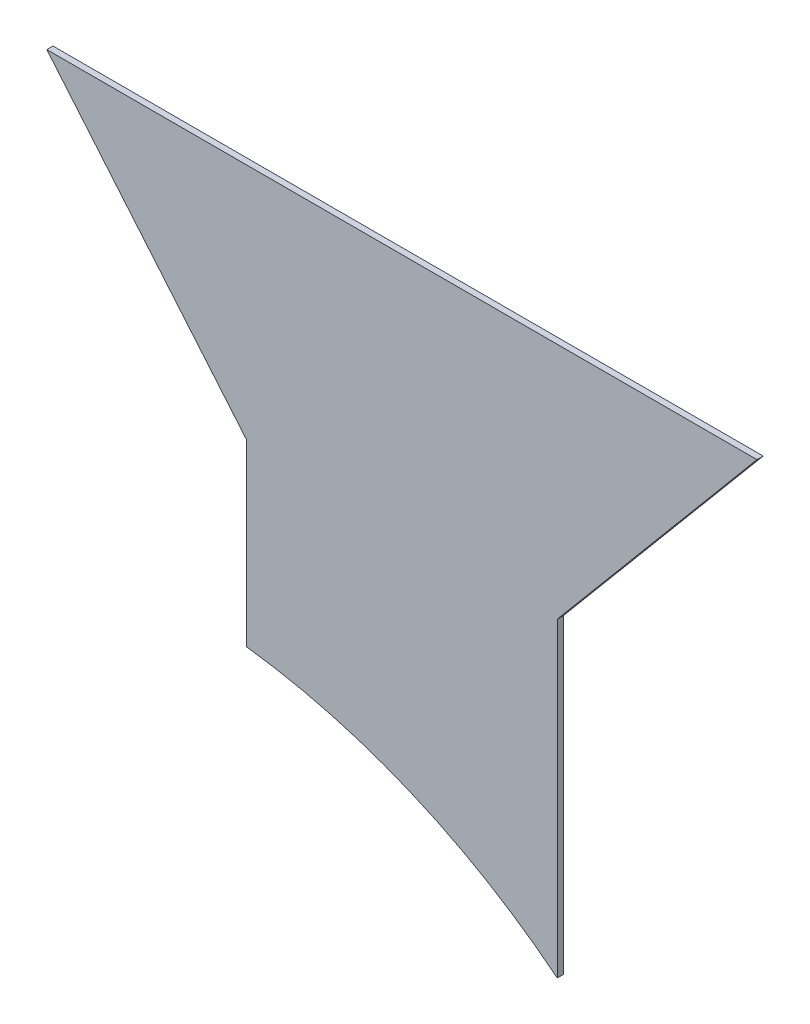
ISO-10303-21;
HEADER;
FILE_DESCRIPTION(('STEP AP214'),'2;1');
FILE_NAME('part.step','',(''),(''),'','','');
FILE_SCHEMA(('AUTOMOTIVE_DESIGN { 1 0 10303 214 1 1 1 1 }'));
ENDSEC;
DATA;
#1=APPLICATION_CONTEXT('core data for automotive mechanical design processes');
#2=APPLICATION_PROTOCOL_DEFINITION('international standard','automotive_design',2000,#1);
#3=PRODUCT_CONTEXT('',#1,'mechanical');
#4=PRODUCT('Part','Part','',(#3));
#5=PRODUCT_RELATED_PRODUCT_CATEGORY('part','',(#4));
#6=PRODUCT_DEFINITION_FORMATION('','',#4);
#7=PRODUCT_DEFINITION_CONTEXT('part definition',#1,'design');
#8=PRODUCT_DEFINITION('design','',#6,#7);
#9=PRODUCT_DEFINITION_SHAPE('','',#8);
#10=(LENGTH_UNIT() NAMED_UNIT(*) SI_UNIT(.MILLI.,.METRE.));
#11=(NAMED_UNIT(*) PLANE_ANGLE_UNIT() SI_UNIT($,.RADIAN.));
#12=(NAMED_UNIT(*) SI_UNIT($,.STERADIAN.) SOLID_ANGLE_UNIT());
#13=UNCERTAINTY_MEASURE_WITH_UNIT(LENGTH_MEASURE(1.E-05),#10,'distance_accuracy_value','');
#14=(GEOMETRIC_REPRESENTATION_CONTEXT(3) GLOBAL_UNCERTAINTY_ASSIGNED_CONTEXT((#13)) GLOBAL_UNIT_ASSIGNED_CONTEXT((#10,
#11,#12)) REPRESENTATION_CONTEXT('',''));
#15=CARTESIAN_POINT('',(0.,0.,0.));
#16=DIRECTION('',(0.,0.,1.));
#17=DIRECTION('',(1.,0.,0.));
#18=AXIS2_PLACEMENT_3D('',#15,#16,#17);
#19=CARTESIAN_POINT('',(-57.15,-118.96721186949,1.51892));
#20=DIRECTION('',(0.,0.,-1.));
#21=DIRECTION('',(-1.,0.,0.));
#22=AXIS2_PLACEMENT_3D('',#19,#20,#21);
#23=CYLINDRICAL_SURFACE('',#22,152.4);
#24=CARTESIAN_POINT('',(-57.15,-118.96721186949,0.));
#25=DIRECTION('',(0.,0.,-1.));
#26=DIRECTION('',(1.,0.,0.));
#27=AXIS2_PLACEMENT_3D('',#24,#25,#26);
#28=CIRCLE('',#27,152.4);
#29=CARTESIAN_POINT('',(-38.1,32.2374755578519,0.));
#30=VERTEX_POINT('',#29);
#31=CARTESIAN_POINT('',(38.1,0.,0.));
#32=VERTEX_POINT('',#31);
#33=EDGE_CURVE('E118',#30,#32,#28,.T.);
#34=ORIENTED_EDGE('',*,*,#33,.T.);
#35=DIRECTION('',(0.,0.,-1.));
#36=VECTOR('',#35,1.);
#37=CARTESIAN_POINT('',(38.1,0.,1.51892));
#38=LINE('',#37,#36);
#39=CARTESIAN_POINT('',(38.1,0.,1.51892));
#40=VERTEX_POINT('',#39);
#41=EDGE_CURVE('E11',#40,#32,#38,.T.);
#42=ORIENTED_EDGE('',*,*,#41,.F.);
#43=CARTESIAN_POINT('',(-57.15,-118.96721186949,1.51892));
#44=DIRECTION('',(0.,0.,-1.));
#45=DIRECTION('',(1.,0.,0.));
#46=AXIS2_PLACEMENT_3D('',#43,#44,#45);
#47=CIRCLE('',#46,152.4);
#48=CARTESIAN_POINT('',(-38.1,32.2374755578519,1.51892));
#49=VERTEX_POINT('',#48);
#50=EDGE_CURVE('E128',#49,#40,#47,.T.);
#51=ORIENTED_EDGE('',*,*,#50,.F.);
#52=DIRECTION('',(0.,0.,-1.));
#53=VECTOR('',#52,1.);
#54=CARTESIAN_POINT('',(-38.1,32.2374755578519,1.51892));
#55=LINE('',#54,#53);
#56=EDGE_CURVE('E114',#49,#30,#55,.T.);
#57=ORIENTED_EDGE('',*,*,#56,.T.);
#58=EDGE_LOOP('',(#34,#42,#51,#57));
#59=FACE_BOUND('',#58,.T.);
#60=ADVANCED_FACE('F34',(#59),#23,.F.);
#61=CARTESIAN_POINT('',(38.1,0.,1.51892));
#62=DIRECTION('',(-1.,0.,0.));
#63=DIRECTION('',(0.,0.,1.));
#64=AXIS2_PLACEMENT_3D('',#61,#62,#63);
#65=PLANE('',#64);
#66=DIRECTION('',(0.,1.,0.));
#67=VECTOR('',#66,1.);
#68=CARTESIAN_POINT('',(38.1,0.,0.));
#69=LINE('',#68,#67);
#70=CARTESIAN_POINT('',(38.1,76.2,0.));
#71=VERTEX_POINT('',#70);
#72=EDGE_CURVE('E121',#32,#71,#69,.T.);
#73=ORIENTED_EDGE('',*,*,#72,.T.);
#74=DIRECTION('',(0.,0.,-1.));
#75=VECTOR('',#74,1.);
#76=CARTESIAN_POINT('',(38.1,76.2,1.51892));
#77=LINE('',#76,#75);
#78=CARTESIAN_POINT('',(38.1,76.2,1.51892));
#79=VERTEX_POINT('',#78);
#80=EDGE_CURVE('E42',#79,#71,#77,.T.);
#81=ORIENTED_EDGE('',*,*,#80,.F.);
#82=DIRECTION('',(0.,1.,0.));
#83=VECTOR('',#82,1.);
#84=CARTESIAN_POINT('',(38.1,0.,1.51892));
#85=LINE('',#84,#83);
#86=EDGE_CURVE('E87',#40,#79,#85,.T.);
#87=ORIENTED_EDGE('',*,*,#86,.F.);
#88=ORIENTED_EDGE('',*,*,#41,.T.);
#89=EDGE_LOOP('',(#73,#81,#87,#88));
#90=FACE_BOUND('',#89,.T.);
#91=ADVANCED_FACE('F152',(#90),#65,.F.);
#92=CARTESIAN_POINT('',(38.1,76.2,1.51892));
#93=DIRECTION('',(-0.766044443118977,0.64278760968654,0.));
#94=DIRECTION('',(-0.64278760968654,-0.766044443118978,0.));
#95=AXIS2_PLACEMENT_3D('',#92,#93,#94);
#96=PLANE('',#95);
#97=DIRECTION('',(0.64278760968654,0.766044443118977,0.));
#98=VECTOR('',#97,1.);
#99=CARTESIAN_POINT('',(38.1,76.2,0.));
#100=LINE('',#99,#98);
#101=CARTESIAN_POINT('',(87.0804158581143,134.572586565666,0.));
#102=VERTEX_POINT('',#101);
#103=EDGE_CURVE('E123',#71,#102,#100,.T.);
#104=ORIENTED_EDGE('',*,*,#103,.T.);
#105=DIRECTION('',(0.,0.,-1.));
#106=VECTOR('',#105,1.);
#107=CARTESIAN_POINT('',(87.0804158581143,134.572586565666,1.51892));
#108=LINE('',#107,#106);
#109=CARTESIAN_POINT('',(87.0804158581143,134.572586565666,1.51892));
#110=VERTEX_POINT('',#109);
#111=EDGE_CURVE('E109',#110,#102,#108,.T.);
#112=ORIENTED_EDGE('',*,*,#111,.F.);
#113=DIRECTION('',(0.64278760968654,0.766044443118977,0.));
#114=VECTOR('',#113,1.);
#115=CARTESIAN_POINT('',(38.1,76.2,1.51892));
#116=LINE('',#115,#114);
#117=EDGE_CURVE('E100',#79,#110,#116,.T.);
#118=ORIENTED_EDGE('',*,*,#117,.F.);
#119=ORIENTED_EDGE('',*,*,#80,.T.);
#120=EDGE_LOOP('',(#104,#112,#118,#119));
#121=FACE_BOUND('',#120,.T.);
#122=ADVANCED_FACE('F134',(#121),#96,.F.);
#123=CARTESIAN_POINT('',(-87.0804158581143,134.572586565666,1.51892));
#124=DIRECTION('',(0.,-1.,0.));
#125=DIRECTION('',(0.,0.,-1.));
#126=AXIS2_PLACEMENT_3D('',#123,#124,#125);
#127=PLANE('',#126);
#128=DIRECTION('',(-1.,0.,0.));
#129=VECTOR('',#128,1.);
#130=CARTESIAN_POINT('',(-87.0804158581143,134.572586565666,0.));
#131=LINE('',#130,#129);
#132=CARTESIAN_POINT('',(-87.0804158581143,134.572586565666,0.));
#133=VERTEX_POINT('',#132);
#134=EDGE_CURVE('E108',#102,#133,#131,.T.);
#135=ORIENTED_EDGE('',*,*,#134,.T.);
#136=DIRECTION('',(0.,0.,-1.));
#137=VECTOR('',#136,1.);
#138=CARTESIAN_POINT('',(-87.0804158581143,134.572586565666,1.51892));
#139=LINE('',#138,#137);
#140=CARTESIAN_POINT('',(-87.0804158581143,134.572586565666,1.51892));
#141=VERTEX_POINT('',#140);
#142=EDGE_CURVE('E105',#141,#133,#139,.T.);
#143=ORIENTED_EDGE('',*,*,#142,.F.);
#144=DIRECTION('',(-1.,0.,0.));
#145=VECTOR('',#144,1.);
#146=CARTESIAN_POINT('',(-87.0804158581143,134.572586565666,1.51892));
#147=LINE('',#146,#145);
#148=EDGE_CURVE('E94',#110,#141,#147,.T.);
#149=ORIENTED_EDGE('',*,*,#148,.F.);
#150=ORIENTED_EDGE('',*,*,#111,.T.);
#151=EDGE_LOOP('',(#135,#143,#149,#150));
#152=FACE_BOUND('',#151,.T.);
#153=ADVANCED_FACE('F106',(#152),#127,.F.);
#154=CARTESIAN_POINT('',(-38.1,76.2,1.51892));
#155=DIRECTION('',(0.766044443118977,0.64278760968654,0.));
#156=DIRECTION('',(-0.64278760968654,0.766044443118978,0.));
#157=AXIS2_PLACEMENT_3D('',#154,#155,#156);
#158=PLANE('',#157);
#159=DIRECTION('',(0.64278760968654,-0.766044443118977,0.));
#160=VECTOR('',#159,1.);
#161=CARTESIAN_POINT('',(-38.1,76.2,0.));
#162=LINE('',#161,#160);
#163=CARTESIAN_POINT('',(-38.1,76.2,0.));
#164=VERTEX_POINT('',#163);
#165=EDGE_CURVE('E73',#133,#164,#162,.T.);
#166=ORIENTED_EDGE('',*,*,#165,.T.);
#167=DIRECTION('',(0.,0.,-1.));
#168=VECTOR('',#167,1.);
#169=CARTESIAN_POINT('',(-38.1,76.2,1.51892));
#170=LINE('',#169,#168);
#171=CARTESIAN_POINT('',(-38.1,76.2,1.51892));
#172=VERTEX_POINT('',#171);
#173=EDGE_CURVE('E110',#172,#164,#170,.T.);
#174=ORIENTED_EDGE('',*,*,#173,.F.);
#175=DIRECTION('',(0.64278760968654,-0.766044443118977,0.));
#176=VECTOR('',#175,1.);
#177=CARTESIAN_POINT('',(-38.1,76.2,1.51892));
#178=LINE('',#177,#176);
#179=EDGE_CURVE('E98',#141,#172,#178,.T.);
#180=ORIENTED_EDGE('',*,*,#179,.F.);
#181=ORIENTED_EDGE('',*,*,#142,.T.);
#182=EDGE_LOOP('',(#166,#174,#180,#181));
#183=FACE_BOUND('',#182,.T.);
#184=ADVANCED_FACE('F112',(#183),#158,.F.);
#185=CARTESIAN_POINT('',(-38.1,32.2374755578519,1.51892));
#186=DIRECTION('',(1.,0.,0.));
#187=DIRECTION('',(0.,1.,0.));
#188=AXIS2_PLACEMENT_3D('',#185,#186,#187);
#189=PLANE('',#188);
#190=DIRECTION('',(0.,-1.,0.));
#191=VECTOR('',#190,1.);
#192=CARTESIAN_POINT('',(-38.1,32.2374755578519,0.));
#193=LINE('',#192,#191);
#194=EDGE_CURVE('E79',#164,#30,#193,.T.);
#195=ORIENTED_EDGE('',*,*,#194,.T.);
#196=ORIENTED_EDGE('',*,*,#56,.F.);
#197=DIRECTION('',(0.,-1.,0.));
#198=VECTOR('',#197,1.);
#199=CARTESIAN_POINT('',(-38.1,32.2374755578519,1.51892));
#200=LINE('',#199,#198);
#201=EDGE_CURVE('E50',#172,#49,#200,.T.);
#202=ORIENTED_EDGE('',*,*,#201,.F.);
#203=ORIENTED_EDGE('',*,*,#173,.T.);
#204=EDGE_LOOP('',(#195,#196,#202,#203));
#205=FACE_BOUND('',#204,.T.);
#206=ADVANCED_FACE('F141',(#205),#189,.F.);
#207=CARTESIAN_POINT('',(-57.15,-118.96721186949,1.51892));
#208=DIRECTION('',(0.,0.,1.));
#209=DIRECTION('',(1.,0.,0.));
#210=AXIS2_PLACEMENT_3D('',#207,#208,#209);
#211=PLANE('',#210);
#212=ORIENTED_EDGE('',*,*,#50,.T.);
#213=ORIENTED_EDGE('',*,*,#86,.T.);
#214=ORIENTED_EDGE('',*,*,#117,.T.);
#215=ORIENTED_EDGE('',*,*,#148,.T.);
#216=ORIENTED_EDGE('',*,*,#179,.T.);
#217=ORIENTED_EDGE('',*,*,#201,.T.);
#218=EDGE_LOOP('',(#212,#213,#214,#215,#216,#217));
#219=FACE_BOUND('',#218,.T.);
#220=ADVANCED_FACE('F96',(#219),#211,.T.);
#221=CARTESIAN_POINT('',(-57.15,-118.96721186949,0.));
#222=DIRECTION('',(0.,0.,1.));
#223=DIRECTION('',(1.,0.,0.));
#224=AXIS2_PLACEMENT_3D('',#221,#222,#223);
#225=PLANE('',#224);
#226=ORIENTED_EDGE('',*,*,#33,.F.);
#227=ORIENTED_EDGE('',*,*,#194,.F.);
#228=ORIENTED_EDGE('',*,*,#165,.F.);
#229=ORIENTED_EDGE('',*,*,#134,.F.);
#230=ORIENTED_EDGE('',*,*,#103,.F.);
#231=ORIENTED_EDGE('',*,*,#72,.F.);
#232=EDGE_LOOP('',(#226,#227,#228,#229,#230,#231));
#233=FACE_BOUND('',#232,.T.);
#234=ADVANCED_FACE('F137',(#233),#225,.F.);
#235=CLOSED_SHELL('',(#60,#91,#122,#153,#184,#206,#220,#234));
#236=MANIFOLD_SOLID_BREP('B2',#235);
#237=ADVANCED_BREP_SHAPE_REPRESENTATION('',(#18,#236),#14);
#238=SHAPE_DEFINITION_REPRESENTATION(#9,#237);
ENDSEC;
END-ISO-10303-21;
